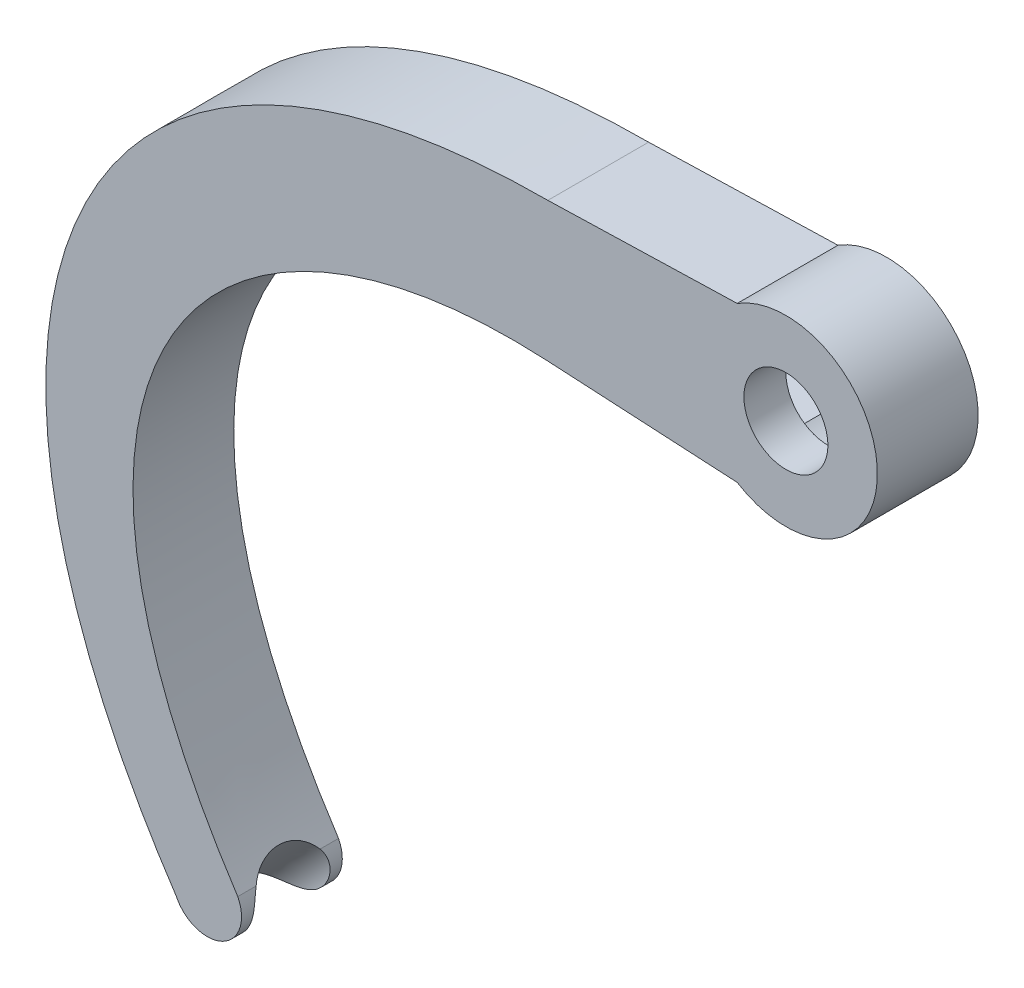
ISO-10303-21;
HEADER;
FILE_DESCRIPTION(('STEP AP214'),'2;1');
FILE_NAME('part.step','',(''),(''),'','','');
FILE_SCHEMA(('AUTOMOTIVE_DESIGN { 1 0 10303 214 1 1 1 1 }'));
ENDSEC;
DATA;
#1=APPLICATION_CONTEXT('core data for automotive mechanical design processes');
#2=APPLICATION_PROTOCOL_DEFINITION('international standard','automotive_design',2000,#1);
#3=PRODUCT_CONTEXT('',#1,'mechanical');
#4=PRODUCT('Part','Part','',(#3));
#5=PRODUCT_RELATED_PRODUCT_CATEGORY('part','',(#4));
#6=PRODUCT_DEFINITION_FORMATION('','',#4);
#7=PRODUCT_DEFINITION_CONTEXT('part definition',#1,'design');
#8=PRODUCT_DEFINITION('design','',#6,#7);
#9=PRODUCT_DEFINITION_SHAPE('','',#8);
#10=(LENGTH_UNIT() NAMED_UNIT(*) SI_UNIT(.MILLI.,.METRE.));
#11=(NAMED_UNIT(*) PLANE_ANGLE_UNIT() SI_UNIT($,.RADIAN.));
#12=(NAMED_UNIT(*) SI_UNIT($,.STERADIAN.) SOLID_ANGLE_UNIT());
#13=UNCERTAINTY_MEASURE_WITH_UNIT(LENGTH_MEASURE(1.E-05),#10,'distance_accuracy_value','');
#14=(GEOMETRIC_REPRESENTATION_CONTEXT(3) GLOBAL_UNCERTAINTY_ASSIGNED_CONTEXT((#13)) GLOBAL_UNIT_ASSIGNED_CONTEXT((#10,
#11,#12)) REPRESENTATION_CONTEXT('',''));
#15=CARTESIAN_POINT('',(0.,0.,0.));
#16=DIRECTION('',(0.,0.,1.));
#17=DIRECTION('',(1.,0.,0.));
#18=AXIS2_PLACEMENT_3D('',#15,#16,#17);
#19=CARTESIAN_POINT('',(-41.9332664034828,-10.07657373215,0.));
#20=DIRECTION('',(0.,0.,-1.));
#21=DIRECTION('',(-1.,0.,0.));
#22=AXIS2_PLACEMENT_3D('',#19,#20,#21);
#23=PLANE('',#22);
#24=DIRECTION('',(-0.999590434211399,-0.0286175441480638,0.));
#25=VECTOR('',#24,1.);
#26=CARTESIAN_POINT('',(-2.89851826531626,4.61531059254175,0.));
#27=LINE('',#26,#25);
#28=CARTESIAN_POINT('',(-2.89851826531626,4.61531059254175,0.));
#29=VERTEX_POINT('',#28);
#30=CARTESIAN_POINT('',(-14.1752919202389,4.29246479803185,0.));
#31=VERTEX_POINT('',#30);
#32=EDGE_CURVE('E161',#29,#31,#27,.T.);
#33=ORIENTED_EDGE('',*,*,#32,.F.);
#34=CARTESIAN_POINT('',(0.,0.,0.));
#35=DIRECTION('',(0.,0.,1.));
#36=DIRECTION('',(1.,0.,0.));
#37=AXIS2_PLACEMENT_3D('',#34,#35,#36);
#38=CIRCLE('',#37,5.45);
#39=CARTESIAN_POINT('',(-2.89851826531626,-4.61531059254175,0.));
#40=VERTEX_POINT('',#39);
#41=EDGE_CURVE('E192',#40,#29,#38,.T.);
#42=ORIENTED_EDGE('',*,*,#41,.F.);
#43=DIRECTION('',(0.998510440144325,-0.0545609835210728,0.));
#44=VECTOR('',#43,1.);
#45=CARTESIAN_POINT('',(-14.2682439340843,-3.9940417605773,0.));
#46=LINE('',#45,#44);
#47=CARTESIAN_POINT('',(-14.2682439340843,-3.9940417605773,0.));
#48=VERTEX_POINT('',#47);
#49=EDGE_CURVE('E187',#48,#40,#46,.T.);
#50=ORIENTED_EDGE('',*,*,#49,.F.);
#51=CARTESIAN_POINT('',(-14.2682439340843,-3.9940417605773,0.));
#52=CARTESIAN_POINT('',(-34.7311657897191,-2.87481631988076,0.));
#53=CARTESIAN_POINT('',(-47.0184138672704,-18.9715456050833,0.));
#54=CARTESIAN_POINT('',(-32.6407533174805,-40.8457065827944,0.));
#55=B_SPLINE_CURVE_WITH_KNOTS('',3,(#51,#52,#53,#54),.UNSPECIFIED.,.F.,.F.,(4,4),(0.,1.),.UNSPECIFIED.);
#56=CARTESIAN_POINT('',(-32.6407533174805,-40.8457065827944,0.));
#57=VERTEX_POINT('',#56);
#58=EDGE_CURVE('E182',#48,#57,#55,.T.);
#59=ORIENTED_EDGE('',*,*,#58,.T.);
#60=CARTESIAN_POINT('',(-34.4577656056994,-41.7788685475317,0.));
#61=DIRECTION('',(0.,0.,1.));
#62=DIRECTION('',(1.,0.,0.));
#63=AXIS2_PLACEMENT_3D('',#60,#61,#62);
#64=CIRCLE('',#63,2.04262696250956);
#65=CARTESIAN_POINT('',(-36.3027853217966,-42.6553542320605,0.));
#66=VERTEX_POINT('',#65);
#67=EDGE_CURVE('E168',#66,#57,#64,.T.);
#68=ORIENTED_EDGE('',*,*,#67,.F.);
#69=CARTESIAN_POINT('',(-14.1752919202389,4.29246479803185,0.));
#70=CARTESIAN_POINT('',(-42.4622601287805,4.28881821773357,0.));
#71=CARTESIAN_POINT('',(-52.533757866495,-18.3720516921241,0.));
#72=CARTESIAN_POINT('',(-36.3027853217966,-42.6553542320605,0.));
#73=B_SPLINE_CURVE_WITH_KNOTS('',3,(#69,#70,#71,#72),.UNSPECIFIED.,.F.,.F.,(4,4),(0.,1.),.UNSPECIFIED.);
#74=EDGE_CURVE('E154',#31,#66,#73,.T.);
#75=ORIENTED_EDGE('',*,*,#74,.F.);
#76=EDGE_LOOP('',(#33,#42,#50,#59,#68,#75));
#77=FACE_BOUND('',#76,.T.);
#78=DIRECTION('',(-0.998510440144325,-0.0545609835210729,0.));
#79=VECTOR('',#78,1.);
#80=CARTESIAN_POINT('',(-2.35931808461709,3.0423869207579,0.));
#81=LINE('',#80,#79);
#82=CARTESIAN_POINT('',(-2.35931808461709,3.0423869207579,0.));
#83=VERTEX_POINT('',#82);
#84=CARTESIAN_POINT('',(-14.1809463604506,2.39642505634638,0.));
#85=VERTEX_POINT('',#84);
#86=EDGE_CURVE('E282',#83,#85,#81,.T.);
#87=ORIENTED_EDGE('',*,*,#86,.T.);
#88=CARTESIAN_POINT('',(-14.05,0.,0.));
#89=DIRECTION('',(0.,0.,1.));
#90=DIRECTION('',(1.,0.,0.));
#91=AXIS2_PLACEMENT_3D('',#88,#89,#90);
#92=CIRCLE('',#91,2.4);
#93=CARTESIAN_POINT('',(-14.1809463604506,-2.39642505634638,0.));
#94=VERTEX_POINT('',#93);
#95=EDGE_CURVE('E64',#85,#94,#92,.T.);
#96=ORIENTED_EDGE('',*,*,#95,.T.);
#97=DIRECTION('',(0.998510440144325,-0.0545609835210727,0.));
#98=VECTOR('',#97,1.);
#99=CARTESIAN_POINT('',(-14.1809463604506,-2.39642505634638,0.));
#100=LINE('',#99,#98);
#101=CARTESIAN_POINT('',(-2.35931808461709,-3.0423869207579,0.));
#102=VERTEX_POINT('',#101);
#103=EDGE_CURVE('E289',#94,#102,#100,.T.);
#104=ORIENTED_EDGE('',*,*,#103,.T.);
#105=CARTESIAN_POINT('',(0.,0.,0.));
#106=DIRECTION('',(0.,0.,1.));
#107=DIRECTION('',(1.,0.,0.));
#108=AXIS2_PLACEMENT_3D('',#105,#106,#107);
#109=CIRCLE('',#108,3.85);
#110=EDGE_CURVE('E286',#102,#83,#109,.T.);
#111=ORIENTED_EDGE('',*,*,#110,.T.);
#112=EDGE_LOOP('',(#87,#96,#104,#111));
#113=FACE_BOUND('',#112,.T.);
#114=ADVANCED_FACE('F37',(#77,#113),#23,.T.);
#115=CARTESIAN_POINT('',(-2.89851826531626,4.61531059254175,6.));
#116=DIRECTION('',(0.0286175441480638,-0.999590434211399,0.));
#117=DIRECTION('',(0.999590434211399,0.0286175441480638,0.));
#118=AXIS2_PLACEMENT_3D('',#115,#116,#117);
#119=PLANE('',#118);
#120=ORIENTED_EDGE('',*,*,#32,.T.);
#121=DIRECTION('',(0.,0.,-1.));
#122=VECTOR('',#121,1.);
#123=CARTESIAN_POINT('',(-14.1752919202389,4.29246479803185,6.));
#124=LINE('',#123,#122);
#125=CARTESIAN_POINT('',(-14.1752919202389,4.29246479803185,6.));
#126=VERTEX_POINT('',#125);
#127=EDGE_CURVE('E51',#126,#31,#124,.T.);
#128=ORIENTED_EDGE('',*,*,#127,.F.);
#129=DIRECTION('',(-0.999590434211399,-0.0286175441480638,0.));
#130=VECTOR('',#129,1.);
#131=CARTESIAN_POINT('',(-2.89851826531626,4.61531059254175,6.));
#132=LINE('',#131,#130);
#133=CARTESIAN_POINT('',(-2.89851826531626,4.61531059254175,6.));
#134=VERTEX_POINT('',#133);
#135=EDGE_CURVE('E194',#134,#126,#132,.T.);
#136=ORIENTED_EDGE('',*,*,#135,.F.);
#137=DIRECTION('',(0.,0.,-1.));
#138=VECTOR('',#137,1.);
#139=CARTESIAN_POINT('',(-2.89851826531626,4.61531059254175,6.));
#140=LINE('',#139,#138);
#141=EDGE_CURVE('E163',#134,#29,#140,.T.);
#142=ORIENTED_EDGE('',*,*,#141,.T.);
#143=EDGE_LOOP('',(#120,#128,#136,#142));
#144=FACE_BOUND('',#143,.T.);
#145=ADVANCED_FACE('F39',(#144),#119,.F.);
#146=CARTESIAN_POINT('',(-14.1752919202389,4.29246479803185,6.));
#147=CARTESIAN_POINT('',(-42.4622601287805,4.28881821773357,6.));
#148=CARTESIAN_POINT('',(-52.533757866495,-18.3720516921241,6.));
#149=CARTESIAN_POINT('',(-36.3027853217966,-42.6553542320605,6.));
#150=B_SPLINE_CURVE_WITH_KNOTS('',3,(#146,#147,#148,#149),.UNSPECIFIED.,.F.,.F.,(4,4),(0.,1.),.UNSPECIFIED.);
#151=DIRECTION('',(0.,0.,-1.));
#152=VECTOR('',#151,1.);
#153=SURFACE_OF_LINEAR_EXTRUSION('',#150,#152);
#154=ORIENTED_EDGE('',*,*,#74,.T.);
#155=DIRECTION('',(0.,0.,-1.));
#156=VECTOR('',#155,1.);
#157=CARTESIAN_POINT('',(-36.3027853217966,-42.6553542320605,6.));
#158=LINE('',#157,#156);
#159=CARTESIAN_POINT('',(-36.3027853217966,-42.6553542320605,6.));
#160=VERTEX_POINT('',#159);
#161=EDGE_CURVE('E141',#160,#66,#158,.T.);
#162=ORIENTED_EDGE('',*,*,#161,.F.);
#163=EDGE_CURVE('E155',#126,#160,#150,.T.);
#164=ORIENTED_EDGE('',*,*,#163,.F.);
#165=ORIENTED_EDGE('',*,*,#127,.T.);
#166=EDGE_LOOP('',(#154,#162,#164,#165));
#167=FACE_BOUND('',#166,.T.);
#168=ADVANCED_FACE('F152',(#167),#153,.F.);
#169=CARTESIAN_POINT('',(-34.4577656056994,-41.7788685475317,6.));
#170=DIRECTION('',(0.,0.,-1.));
#171=DIRECTION('',(-1.,0.,0.));
#172=AXIS2_PLACEMENT_3D('',#169,#170,#171);
#173=CYLINDRICAL_SURFACE('',#172,2.04262696250956);
#174=DIRECTION('',(0.,0.,-1.));
#175=VECTOR('',#174,1.);
#176=CARTESIAN_POINT('',(-32.6407533174805,-40.8457065827944,6.));
#177=LINE('',#176,#175);
#178=CARTESIAN_POINT('',(-32.6407533174805,-40.8457065827944,1.09503326228966));
#179=VERTEX_POINT('',#178);
#180=EDGE_CURVE('E135',#179,#57,#177,.T.);
#181=ORIENTED_EDGE('',*,*,#180,.F.);
#182=CARTESIAN_POINT('',(-32.6407533174804,-40.8457065827945,1.09503326228966));
#183=CARTESIAN_POINT('',(-32.6220745355062,-40.8820558724806,1.0687277977726));
#184=CARTESIAN_POINT('',(-32.6040911412782,-40.9197782200192,1.04382025247696));
#185=CARTESIAN_POINT('',(-32.5699296706582,-40.9977151214801,0.996830357177304));
#186=CARTESIAN_POINT('',(-32.5537515457497,-41.037929608381,0.974747931246036));
#187=CARTESIAN_POINT('',(-32.5236779395172,-41.1204237643003,0.933523713846802));
#188=CARTESIAN_POINT('',(-32.5097730790598,-41.1626939634419,0.914369861898414));
#189=CARTESIAN_POINT('',(-32.4845179807851,-41.2491045182225,0.878840719121569));
#190=CARTESIAN_POINT('',(-32.4731675380123,-41.2932447234824,0.862465205397218));
#191=CARTESIAN_POINT('',(-32.4433979741694,-41.428038739852,0.817319240428282));
#192=CARTESIAN_POINT('',(-32.4292664084087,-41.5210504774572,0.792536906367486));
#193=CARTESIAN_POINT('',(-32.4140933560802,-41.7100073273682,0.752093156564916));
#194=CARTESIAN_POINT('',(-32.4130565214455,-41.8059534699949,0.73643498408661));
#195=CARTESIAN_POINT('',(-32.4247275498036,-41.9993315275777,0.711865207444093));
#196=CARTESIAN_POINT('',(-32.4376441069325,-42.0967639070497,0.703059525105339));
#197=CARTESIAN_POINT('',(-32.4774439249368,-42.2890758503037,0.69024824720019));
#198=CARTESIAN_POINT('',(-32.5043362600976,-42.3839537133242,0.68624577588836));
#199=CARTESIAN_POINT('',(-32.57509966898,-42.5786959586113,0.680676717238283));
#200=CARTESIAN_POINT('',(-32.6204642460473,-42.6780283208868,0.679412118488387));
#201=CARTESIAN_POINT('',(-32.7264253508892,-42.8681998254043,0.678088108703343));
#202=CARTESIAN_POINT('',(-32.787023204055,-42.9590382276742,0.67802880257304));
#203=CARTESIAN_POINT('',(-32.9253414906563,-43.1342567493569,0.677967891577978));
#204=CARTESIAN_POINT('',(-33.0037741418237,-43.2180761214555,0.677969363853455));
#205=CARTESIAN_POINT('',(-33.1735724997054,-43.3714335399114,0.678027846176016));
#206=CARTESIAN_POINT('',(-33.2649413688916,-43.4409680838885,0.678084869823654));
#207=CARTESIAN_POINT('',(-33.4583960197149,-43.5640267860091,0.679604908684623));
#208=CARTESIAN_POINT('',(-33.5605239882093,-43.6174844928451,0.681073656972305));
#209=CARTESIAN_POINT('',(-33.7723113532011,-43.7064673345895,0.687993748797654));
#210=CARTESIAN_POINT('',(-33.8819712716008,-43.7419912254047,0.693445368568312));
#211=CARTESIAN_POINT('',(-34.0482157327862,-43.780811717667,0.70708570052062));
#212=CARTESIAN_POINT('',(-34.1034355069909,-43.7913104977763,0.712473164078317));
#213=CARTESIAN_POINT('',(-34.2142847405185,-43.8077038324202,0.725482866210588));
#214=CARTESIAN_POINT('',(-34.269913974032,-43.8136007570793,0.733103951601973));
#215=CARTESIAN_POINT('',(-34.3809998100799,-43.820811116298,0.751012141451185));
#216=CARTESIAN_POINT('',(-34.436456508161,-43.8221278523896,0.761297319805349));
#217=CARTESIAN_POINT('',(-34.5466369734369,-43.8203044543135,0.784944839957722));
#218=CARTESIAN_POINT('',(-34.6013608305543,-43.8171648721068,0.798306800492915));
#219=CARTESIAN_POINT('',(-34.7043662894247,-43.8071521778731,0.827035574577063));
#220=CARTESIAN_POINT('',(-34.7527703594427,-43.8006572677649,0.842096378703845));
#221=CARTESIAN_POINT('',(-34.848006729531,-43.7844533783087,0.875223270784623));
#222=CARTESIAN_POINT('',(-34.8948385120502,-43.7747433518446,0.89329033687894));
#223=CARTESIAN_POINT('',(-34.9864338822384,-43.7524576367463,0.932529518658113));
#224=CARTESIAN_POINT('',(-35.0311990230519,-43.7398841436929,0.953699250944259));
#225=CARTESIAN_POINT('',(-35.1183169611923,-43.7122824623302,0.999182693206804));
#226=CARTESIAN_POINT('',(-35.1606688604072,-43.6972533680884,1.02349756281023));
#227=CARTESIAN_POINT('',(-35.277496837116,-43.6515607442756,1.09726230793636));
#228=CARTESIAN_POINT('',(-35.3486853237578,-43.6184649473605,1.15051192532821));
#229=CARTESIAN_POINT('',(-35.4804103893852,-43.5486447470524,1.26681160939616));
#230=CARTESIAN_POINT('',(-35.540940759043,-43.5119182477686,1.32986734901833));
#231=CARTESIAN_POINT('',(-35.655308761074,-43.4351622395027,1.46955762770075));
#232=CARTESIAN_POINT('',(-35.708305676322,-43.395091350914,1.5468554375091));
#233=CARTESIAN_POINT('',(-35.8023557385352,-43.317736686436,1.70952851931919));
#234=CARTESIAN_POINT('',(-35.84341350868,-43.2804518358797,1.79490064769648));
#235=CARTESIAN_POINT('',(-35.9200374751139,-43.2062291506407,1.98559953498169));
#236=CARTESIAN_POINT('',(-35.9538431257085,-43.1701907078841,2.09199444454442));
#237=CARTESIAN_POINT('',(-35.9948583352088,-43.1242623702573,2.25612053436973));
#238=CARTESIAN_POINT('',(-36.0069151261159,-43.1103069906349,2.31158964801472));
#239=CARTESIAN_POINT('',(-36.0279805775476,-43.0853961377285,2.42382929335551));
#240=CARTESIAN_POINT('',(-36.0369861685367,-43.0744436875193,2.48060107462212));
#241=CARTESIAN_POINT('',(-36.059784553719,-43.0463378666881,2.65368264922793));
#242=CARTESIAN_POINT('',(-36.0690519220353,-43.0343007801625,2.77149430671863));
#243=CARTESIAN_POINT('',(-36.0761653321202,-43.0251212864623,3.00804248645508));
#244=CARTESIAN_POINT('',(-36.074011572471,-43.0279786203145,3.12677899258438));
#245=CARTESIAN_POINT('',(-36.0618965104243,-43.0434299115403,3.30656770952968));
#246=CARTESIAN_POINT('',(-36.056095833202,-43.0507971209983,3.36841838668217));
#247=CARTESIAN_POINT('',(-36.0411649830849,-43.0693404785519,3.49109996479183));
#248=CARTESIAN_POINT('',(-36.0320375150728,-43.0805135317839,3.5519316523401));
#249=CARTESIAN_POINT('',(-36.0103037917086,-43.1063599725711,3.67222177951734));
#250=CARTESIAN_POINT('',(-35.9976968972214,-43.1210340031529,3.73167996467131));
#251=CARTESIAN_POINT('',(-35.9688076639993,-43.1534771440972,3.84885238595402));
#252=CARTESIAN_POINT('',(-35.9525243455893,-43.1712470791522,3.90656615258226));
#253=CARTESIAN_POINT('',(-35.9162559272668,-43.2091872554053,4.01925187499024));
#254=CARTESIAN_POINT('',(-35.8963126235021,-43.2293295571905,4.07424668018053));
#255=CARTESIAN_POINT('',(-35.8523850928272,-43.2716144941285,4.18177749023772));
#256=CARTESIAN_POINT('',(-35.8284023407947,-43.2937563978256,4.23431438362013));
#257=CARTESIAN_POINT('',(-35.7780097894387,-43.3378163715659,4.33296438080898));
#258=CARTESIAN_POINT('',(-35.7518922973123,-43.3596391719485,4.37926889576299));
#259=CARTESIAN_POINT('',(-35.6957912760213,-43.4039525755436,4.46919619988889));
#260=CARTESIAN_POINT('',(-35.6658039640778,-43.4264438153807,4.51281630258253));
#261=CARTESIAN_POINT('',(-35.5744858581311,-43.4907435191728,4.63304131018049));
#262=CARTESIAN_POINT('',(-35.5082598687128,-43.5326438343903,4.70599840366427));
#263=CARTESIAN_POINT('',(-35.3621382050694,-43.6122641759943,4.83956812918746));
#264=CARTESIAN_POINT('',(-35.2822401780771,-43.6499834810433,4.90017863261189));
#265=CARTESIAN_POINT('',(-35.1130164609566,-43.7156035194152,5.00613903751315));
#266=CARTESIAN_POINT('',(-35.024048169081,-43.7437662729535,5.05189437745837));
#267=CARTESIAN_POINT('',(-34.8378453787744,-43.7880994018402,5.13052808010024));
#268=CARTESIAN_POINT('',(-34.7406134044559,-43.8042734245344,5.16341035774628));
#269=CARTESIAN_POINT('',(-34.5502981101528,-43.8214433626216,5.2153438892698));
#270=CARTESIAN_POINT('',(-34.4575710483966,-43.8236189472126,5.23533743516759));
#271=CARTESIAN_POINT('',(-34.2713678575712,-43.8151085848169,5.26751928083455));
#272=CARTESIAN_POINT('',(-34.1778915171218,-43.804418871732,5.27970529348008));
#273=CARTESIAN_POINT('',(-33.9870084742011,-43.7690232872379,5.29893494992747));
#274=CARTESIAN_POINT('',(-33.8897204484149,-43.7434845014914,5.30561029768432));
#275=CARTESIAN_POINT('',(-33.6997819726218,-43.6783109898578,5.3149224238759));
#276=CARTESIAN_POINT('',(-33.6071335382778,-43.6386701969553,5.31755746147907));
#277=CARTESIAN_POINT('',(-33.419662773451,-43.5415081744841,5.32097260122543));
#278=CARTESIAN_POINT('',(-33.3255576455255,-43.482590399137,5.32153968133249));
#279=CARTESIAN_POINT('',(-33.1481240750929,-43.3503063405342,5.32205860158612));
#280=CARTESIAN_POINT('',(-33.0647967680405,-43.2769385370036,5.32201037696292));
#281=CARTESIAN_POINT('',(-32.9083376289744,-43.1148091736158,5.32201342232842));
#282=CARTESIAN_POINT('',(-32.8356802782925,-43.025588865463,5.32206833313781));
#283=CARTESIAN_POINT('',(-32.706321949199,-42.8361885564295,5.32171665012835));
#284=CARTESIAN_POINT('',(-32.6496279810467,-42.7360037672733,5.32130985394589));
#285=CARTESIAN_POINT('',(-32.5537698971929,-42.527419643751,5.31815058504528));
#286=CARTESIAN_POINT('',(-32.51463318443,-42.4190077749228,5.3153944648661));
#287=CARTESIAN_POINT('',(-32.4551842779756,-42.1973334462995,5.30454548177612));
#288=CARTESIAN_POINT('',(-32.4348609047998,-42.084073909064,5.29645579314149));
#289=CARTESIAN_POINT('',(-32.4189526371379,-41.9154275662223,5.27780793955972));
#290=CARTESIAN_POINT('',(-32.4160181849771,-41.8602679683904,5.27066523167248));
#291=CARTESIAN_POINT('',(-32.4146005634156,-41.7502877815356,5.25384820122454));
#292=CARTESIAN_POINT('',(-32.416115016718,-41.6954670271389,5.24417523323852));
#293=CARTESIAN_POINT('',(-32.4234646055162,-41.5867373592428,5.22190308009144));
#294=CARTESIAN_POINT('',(-32.4292981774195,-41.5328281229809,5.20930495501821));
#295=CARTESIAN_POINT('',(-32.4450422106987,-41.4265141484661,5.18084101307702));
#296=CARTESIAN_POINT('',(-32.4549502404827,-41.3741085327898,5.16497714798217));
#297=CARTESIAN_POINT('',(-32.4766750226527,-41.279273480035,5.13243357233907));
#298=CARTESIAN_POINT('',(-32.4879636567345,-41.2365495651157,5.11625480556181));
#299=CARTESIAN_POINT('',(-32.5129243674463,-41.1529117280944,5.08127143653079));
#300=CARTESIAN_POINT('',(-32.5265962876764,-41.1119976874427,5.06246700659861));
#301=CARTESIAN_POINT('',(-32.5560530180107,-41.0321213751724,5.02210815799233));
#302=CARTESIAN_POINT('',(-32.5718459776711,-40.9931674706489,5.00054314825586));
#303=CARTESIAN_POINT('',(-32.6051250614893,-40.9176125882504,4.954747094853));
#304=CARTESIAN_POINT('',(-32.622611416337,-40.8810119320899,4.93051568788392));
#305=CARTESIAN_POINT('',(-32.6407533174804,-40.8457065827946,4.90496673771031));
#306=B_SPLINE_CURVE_WITH_KNOTS('',3,(#182,#183,#184,#185,#186,#187,#188,#189,#190,#191,#192,
#193,#194,#195,#196,#197,#198,#199,#200,#201,#202,#203,#204,#205,#206,#207,#208,#209,#210,#211,
#212,#213,#214,#215,#216,#217,#218,#219,#220,#221,#222,#223,#224,#225,#226,#227,#228,#229,#230,
#231,#232,#233,#234,#235,#236,#237,#238,#239,#240,#241,#242,#243,#244,#245,#246,#247,#248,#249,
#250,#251,#252,#253,#254,#255,#256,#257,#258,#259,#260,#261,#262,#263,#264,#265,#266,#267,#268,
#269,#270,#271,#272,#273,#274,#275,#276,#277,#278,#279,#280,#281,#282,#283,#284,#285,#286,#287,
#288,#289,#290,#291,#292,#293,#294,#295,#296,#297,#298,#299,#300,#301,#302,#303,#304,#305),
.UNSPECIFIED.,.F.,.F.,(4,2,2,2,2,2,2,2,2,2,2,2,2,2,2,2,2,2,2,2,2,2,2,2,2,2,2,2,2,2,2,2,2,2,2,2,
2,2,2,2,2,2,2,2,2,2,2,2,2,2,2,2,2,2,2,2,2,2,2,2,2,4),(0.,0.14576635828153,0.291528798156639,
0.436673778110588,0.581807108102921,0.872127517188236,1.16255106036363,1.45737924229694,
1.75239909182348,2.07858438762317,2.40479807343445,2.74754690327221,3.09037966885818,
3.43461060135937,3.77886541034463,3.94807498204079,4.1171973469731,4.28619777833417,
4.45517727907083,4.60829190643422,4.76145645010642,4.91450394696879,5.06760803487979,
5.35082715317151,5.63421073045381,5.93881713256242,6.2433054247829,6.59368902271421,
6.76890993489393,6.94430660114618,7.29910991047247,7.65390705075918,7.84139708667637,
8.02873502064223,8.21610738960151,8.40352974766615,8.5889317535275,8.77426621182923,
8.94647086477887,9.11884514257452,9.4384436327961,9.75809717687675,10.0681013862676,
10.3780112439561,10.6614193850928,10.9449105093482,11.2460898979095,11.5473990179469,
11.8789879966711,12.2106118802386,12.5541630011611,12.8978647567975,13.2421011031982,
13.5861327618641,13.753032583483,13.9198432375015,14.0865935328132,14.2532444574576,
14.3942581535202,14.5352625992376,14.6768252052058,14.8184071233406),.UNSPECIFIED.);
#307=CARTESIAN_POINT('',(-32.6407533174804,-40.8457065827945,4.90496673771047));
#308=VERTEX_POINT('',#307);
#309=EDGE_CURVE('E56',#179,#308,#306,.T.);
#310=ORIENTED_EDGE('',*,*,#309,.T.);
#311=CARTESIAN_POINT('',(-32.6407533174805,-40.8457065827944,6.));
#312=VERTEX_POINT('',#311);
#313=EDGE_CURVE('E132',#312,#308,#177,.T.);
#314=ORIENTED_EDGE('',*,*,#313,.F.);
#315=CARTESIAN_POINT('',(-34.4577656056994,-41.7788685475317,6.));
#316=DIRECTION('',(0.,0.,1.));
#317=DIRECTION('',(1.,0.,0.));
#318=AXIS2_PLACEMENT_3D('',#315,#316,#317);
#319=CIRCLE('',#318,2.04262696250956);
#320=EDGE_CURVE('E208',#160,#312,#319,.T.);
#321=ORIENTED_EDGE('',*,*,#320,.F.);
#322=ORIENTED_EDGE('',*,*,#161,.T.);
#323=ORIENTED_EDGE('',*,*,#67,.T.);
#324=EDGE_LOOP('',(#181,#310,#314,#321,#322,#323));
#325=FACE_BOUND('',#324,.T.);
#326=ADVANCED_FACE('F130',(#325),#173,.T.);
#327=CARTESIAN_POINT('',(-14.2682439340843,-3.9940417605773,6.));
#328=CARTESIAN_POINT('',(-34.7311657897191,-2.87481631988076,6.));
#329=CARTESIAN_POINT('',(-47.0184138672704,-18.9715456050833,6.));
#330=CARTESIAN_POINT('',(-32.6407533174805,-40.8457065827944,6.));
#331=B_SPLINE_CURVE_WITH_KNOTS('',3,(#327,#328,#329,#330),.UNSPECIFIED.,.F.,.F.,(4,4),(0.,1.),.UNSPECIFIED.);
#332=DIRECTION('',(0.,0.,-1.));
#333=VECTOR('',#332,1.);
#334=SURFACE_OF_LINEAR_EXTRUSION('',#331,#333);
#335=CARTESIAN_POINT('',(-32.6407533174804,-40.8457065827945,1.09503326228966));
#336=CARTESIAN_POINT('',(-32.6707717794153,-40.8000374671283,1.13132589126215));
#337=CARTESIAN_POINT('',(-32.6999187418871,-40.7555407018418,1.16982213492498));
#338=CARTESIAN_POINT('',(-32.7563022274618,-40.6692001630969,1.25101207092125));
#339=CARTESIAN_POINT('',(-32.783537834231,-40.6273576630459,1.29370775329187));
#340=CARTESIAN_POINT('',(-32.8359061042891,-40.5466721041824,1.38305838951742));
#341=CARTESIAN_POINT('',(-32.8610384561357,-40.5078294896474,1.42971392768028));
#342=CARTESIAN_POINT('',(-32.9090133525323,-40.4334871657255,1.52668557805962));
#343=CARTESIAN_POINT('',(-32.9318568304473,-40.3979860940733,1.57700018360459));
#344=CARTESIAN_POINT('',(-32.9745612114682,-40.3314607152494,1.67970338196523));
#345=CARTESIAN_POINT('',(-32.994482438364,-40.3003466234169,1.73200858716873));
#346=CARTESIAN_POINT('',(-33.0318790989632,-40.2418177924835,1.83954670611475));
#347=CARTESIAN_POINT('',(-33.0493519265236,-40.214406996367,1.89478265451548));
#348=CARTESIAN_POINT('',(-33.0976104692377,-40.1385671056776,2.06341214302111));
#349=CARTESIAN_POINT('',(-33.1246040136865,-40.0959558657306,2.18061284050957));
#350=CARTESIAN_POINT('',(-33.1674837011866,-40.0281364447919,2.42187555788211));
#351=CARTESIAN_POINT('',(-33.1833728609801,-40.0029235371967,2.54593570435993));
#352=CARTESIAN_POINT('',(-33.1984003765217,-39.9790631511722,2.73298449350545));
#353=CARTESIAN_POINT('',(-33.2019491110799,-39.9734248081233,2.79482235859401));
#354=CARTESIAN_POINT('',(-33.206249435844,-39.9665915433258,2.91880228146406));
#355=CARTESIAN_POINT('',(-33.2070034468932,-39.9653927759319,2.98094402926544));
#356=CARTESIAN_POINT('',(-33.2057211158691,-39.9674307904694,3.10416905816639));
#357=CARTESIAN_POINT('',(-33.2037273264176,-39.9705999307366,3.1652539758451));
#358=CARTESIAN_POINT('',(-33.1970416039768,-39.9812207781195,3.28690196349449));
#359=CARTESIAN_POINT('',(-33.1923496534616,-39.9886725130526,3.34746503007291));
#360=CARTESIAN_POINT('',(-33.180305267606,-40.0077843405542,3.46762894914944));
#361=CARTESIAN_POINT('',(-33.1729540662719,-40.0194424811636,3.52723023457658));
#362=CARTESIAN_POINT('',(-33.1556452999691,-40.046858902899,3.64513001157972));
#363=CARTESIAN_POINT('',(-33.1456857386026,-40.0626203245565,3.70342746796821));
#364=CARTESIAN_POINT('',(-33.1117163140888,-40.1162988449354,3.87718648404486));
#365=CARTESIAN_POINT('',(-33.0837618495907,-40.1603770252344,3.99005917777625));
#366=CARTESIAN_POINT('',(-33.0182329328003,-40.2632392644667,4.20588375450156));
#367=CARTESIAN_POINT('',(-32.9806553361128,-40.3220281300289,4.30883237960513));
#368=CARTESIAN_POINT('',(-32.9181317544818,-40.4193176942957,4.45339792113911));
#369=CARTESIAN_POINT('',(-32.8963992200512,-40.4530571036623,4.49971739812613));
#370=CARTESIAN_POINT('',(-32.8509954672815,-40.5233539628618,4.58907287217802));
#371=CARTESIAN_POINT('',(-32.8273265535772,-40.5599080597549,4.63211265807958));
#372=CARTESIAN_POINT('',(-32.7775667671874,-40.6365342154443,4.7157554877758));
#373=CARTESIAN_POINT('',(-32.7514305794132,-40.6766707748459,4.75627233004417));
#374=CARTESIAN_POINT('',(-32.6973810470962,-40.7594144532318,4.83352234667172));
#375=CARTESIAN_POINT('',(-32.6694658971984,-40.8020240779301,4.87025157500826));
#376=CARTESIAN_POINT('',(-32.6407533174805,-40.8457065827944,4.90496673771042));
#377=B_SPLINE_CURVE_WITH_KNOTS('',3,(#335,#336,#337,#338,#339,#340,#341,#342,#343,#344,#345,
#346,#347,#348,#349,#350,#351,#352,#353,#354,#355,#356,#357,#358,#359,#360,#361,#362,#363,#364,
#365,#366,#367,#368,#369,#370,#371,#372,#373,#374,#375,#376),.UNSPECIFIED.,.F.,.F.,(4,2,2,2,2,2,
2,2,2,2,2,2,2,2,2,2,2,2,2,2,4),(0.,0.196766592295486,0.39362688208892,0.590516270840192,
0.787325041757335,0.979209679194269,1.17129703708369,1.55216004275632,1.93291953863023,
2.11932201108642,2.30556298034606,2.48895199110019,2.67234219306158,2.855647403034,
3.0390933240406,3.4103748791041,3.78177790697811,3.9654877169104,4.14898197464843,
4.33699871739656,4.52520940231183),.UNSPECIFIED.);
#378=EDGE_CURVE('E11',#179,#308,#377,.T.);
#379=ORIENTED_EDGE('',*,*,#378,.F.);
#380=ORIENTED_EDGE('',*,*,#180,.T.);
#381=ORIENTED_EDGE('',*,*,#58,.F.);
#382=DIRECTION('',(0.,0.,-1.));
#383=VECTOR('',#382,1.);
#384=CARTESIAN_POINT('',(-14.2682439340843,-3.9940417605773,6.));
#385=LINE('',#384,#383);
#386=CARTESIAN_POINT('',(-14.2682439340843,-3.9940417605773,6.));
#387=VERTEX_POINT('',#386);
#388=EDGE_CURVE('E145',#387,#48,#385,.T.);
#389=ORIENTED_EDGE('',*,*,#388,.F.);
#390=EDGE_CURVE('E140',#387,#312,#331,.T.);
#391=ORIENTED_EDGE('',*,*,#390,.T.);
#392=ORIENTED_EDGE('',*,*,#313,.T.);
#393=EDGE_LOOP('',(#379,#380,#381,#389,#391,#392));
#394=FACE_BOUND('',#393,.T.);
#395=ADVANCED_FACE('F138',(#394),#334,.T.);
#396=CARTESIAN_POINT('',(-14.2682439340843,-3.9940417605773,6.));
#397=DIRECTION('',(0.0545609835210728,0.998510440144325,0.));
#398=DIRECTION('',(-0.998510440144325,0.0545609835210728,0.));
#399=AXIS2_PLACEMENT_3D('',#396,#397,#398);
#400=PLANE('',#399);
#401=ORIENTED_EDGE('',*,*,#49,.T.);
#402=DIRECTION('',(0.,0.,-1.));
#403=VECTOR('',#402,1.);
#404=CARTESIAN_POINT('',(-2.89851826531626,-4.61531059254175,6.));
#405=LINE('',#404,#403);
#406=CARTESIAN_POINT('',(-2.89851826531626,-4.61531059254175,6.));
#407=VERTEX_POINT('',#406);
#408=EDGE_CURVE('E195',#407,#40,#405,.T.);
#409=ORIENTED_EDGE('',*,*,#408,.F.);
#410=DIRECTION('',(0.998510440144325,-0.0545609835210728,0.));
#411=VECTOR('',#410,1.);
#412=CARTESIAN_POINT('',(-14.2682439340843,-3.9940417605773,6.));
#413=LINE('',#412,#411);
#414=EDGE_CURVE('E204',#387,#407,#413,.T.);
#415=ORIENTED_EDGE('',*,*,#414,.F.);
#416=ORIENTED_EDGE('',*,*,#388,.T.);
#417=EDGE_LOOP('',(#401,#409,#415,#416));
#418=FACE_BOUND('',#417,.T.);
#419=ADVANCED_FACE('F203',(#418),#400,.F.);
#420=CARTESIAN_POINT('',(0.,0.,6.));
#421=DIRECTION('',(0.,0.,-1.));
#422=DIRECTION('',(-1.,0.,0.));
#423=AXIS2_PLACEMENT_3D('',#420,#421,#422);
#424=CYLINDRICAL_SURFACE('',#423,5.45);
#425=ORIENTED_EDGE('',*,*,#41,.T.);
#426=ORIENTED_EDGE('',*,*,#141,.F.);
#427=CARTESIAN_POINT('',(0.,0.,6.));
#428=DIRECTION('',(0.,0.,1.));
#429=DIRECTION('',(1.,0.,0.));
#430=AXIS2_PLACEMENT_3D('',#427,#428,#429);
#431=CIRCLE('',#430,5.45);
#432=EDGE_CURVE('E173',#407,#134,#431,.T.);
#433=ORIENTED_EDGE('',*,*,#432,.F.);
#434=ORIENTED_EDGE('',*,*,#408,.T.);
#435=EDGE_LOOP('',(#425,#426,#433,#434));
#436=FACE_BOUND('',#435,.T.);
#437=ADVANCED_FACE('F268',(#436),#424,.T.);
#438=CARTESIAN_POINT('',(-41.9332664034828,-10.07657373215,6.));
#439=DIRECTION('',(0.,0.,-1.));
#440=DIRECTION('',(-1.,0.,0.));
#441=AXIS2_PLACEMENT_3D('',#438,#439,#440);
#442=PLANE('',#441);
#443=CARTESIAN_POINT('',(0.,0.,6.));
#444=DIRECTION('',(0.,0.,-1.));
#445=DIRECTION('',(-1.,0.,0.));
#446=AXIS2_PLACEMENT_3D('',#443,#444,#445);
#447=CIRCLE('',#446,2.5);
#448=CARTESIAN_POINT('',(-2.5,0.,6.));
#449=VERTEX_POINT('',#448);
#450=EDGE_CURVE('E293',#449,#449,#447,.T.);
#451=ORIENTED_EDGE('',*,*,#450,.T.);
#452=EDGE_LOOP('',(#451));
#453=FACE_BOUND('',#452,.T.);
#454=ORIENTED_EDGE('',*,*,#135,.T.);
#455=ORIENTED_EDGE('',*,*,#163,.T.);
#456=ORIENTED_EDGE('',*,*,#320,.T.);
#457=ORIENTED_EDGE('',*,*,#390,.F.);
#458=ORIENTED_EDGE('',*,*,#414,.T.);
#459=ORIENTED_EDGE('',*,*,#432,.T.);
#460=EDGE_LOOP('',(#454,#455,#456,#457,#458,#459));
#461=FACE_BOUND('',#460,.T.);
#462=ADVANCED_FACE('F265',(#453,#461),#442,.F.);
#463=CARTESIAN_POINT('',(-14.05,0.,3.5));
#464=DIRECTION('',(0.,0.,-1.));
#465=DIRECTION('',(-1.,0.,0.));
#466=AXIS2_PLACEMENT_3D('',#463,#464,#465);
#467=CYLINDRICAL_SURFACE('',#466,2.4);
#468=ORIENTED_EDGE('',*,*,#95,.F.);
#469=DIRECTION('',(0.,0.,-1.));
#470=VECTOR('',#469,1.);
#471=CARTESIAN_POINT('',(-14.1809463604506,2.39642505634638,3.5));
#472=LINE('',#471,#470);
#473=CARTESIAN_POINT('',(-14.1809463604506,2.39642505634638,3.5));
#474=VERTEX_POINT('',#473);
#475=EDGE_CURVE('E279',#474,#85,#472,.T.);
#476=ORIENTED_EDGE('',*,*,#475,.F.);
#477=CARTESIAN_POINT('',(-14.05,0.,3.5));
#478=DIRECTION('',(0.,0.,1.));
#479=DIRECTION('',(1.,0.,0.));
#480=AXIS2_PLACEMENT_3D('',#477,#478,#479);
#481=CIRCLE('',#480,2.4);
#482=CARTESIAN_POINT('',(-14.1809463604506,-2.39642505634638,3.5));
#483=VERTEX_POINT('',#482);
#484=EDGE_CURVE('E285',#474,#483,#481,.T.);
#485=ORIENTED_EDGE('',*,*,#484,.T.);
#486=DIRECTION('',(0.,0.,-1.));
#487=VECTOR('',#486,1.);
#488=CARTESIAN_POINT('',(-14.1809463604506,-2.39642505634638,3.5));
#489=LINE('',#488,#487);
#490=EDGE_CURVE('E166',#483,#94,#489,.T.);
#491=ORIENTED_EDGE('',*,*,#490,.T.);
#492=EDGE_LOOP('',(#468,#476,#485,#491));
#493=FACE_BOUND('',#492,.T.);
#494=ADVANCED_FACE('F261',(#493),#467,.F.);
#495=CARTESIAN_POINT('',(-14.1809463604506,-2.39642505634638,3.5));
#496=DIRECTION('',(0.0545609835210727,0.998510440144325,0.));
#497=DIRECTION('',(-0.998510440144325,0.0545609835210727,0.));
#498=AXIS2_PLACEMENT_3D('',#495,#496,#497);
#499=PLANE('',#498);
#500=ORIENTED_EDGE('',*,*,#103,.F.);
#501=ORIENTED_EDGE('',*,*,#490,.F.);
#502=DIRECTION('',(0.998510440144325,-0.0545609835210727,0.));
#503=VECTOR('',#502,1.);
#504=CARTESIAN_POINT('',(-14.1809463604506,-2.39642505634638,3.5));
#505=LINE('',#504,#503);
#506=CARTESIAN_POINT('',(-2.35931808461709,-3.0423869207579,3.5));
#507=VERTEX_POINT('',#506);
#508=EDGE_CURVE('E297',#483,#507,#505,.T.);
#509=ORIENTED_EDGE('',*,*,#508,.T.);
#510=DIRECTION('',(0.,0.,-1.));
#511=VECTOR('',#510,1.);
#512=CARTESIAN_POINT('',(-2.35931808461709,-3.0423869207579,3.5));
#513=LINE('',#512,#511);
#514=EDGE_CURVE('E170',#507,#102,#513,.T.);
#515=ORIENTED_EDGE('',*,*,#514,.T.);
#516=EDGE_LOOP('',(#500,#501,#509,#515));
#517=FACE_BOUND('',#516,.T.);
#518=ADVANCED_FACE('F257',(#517),#499,.T.);
#519=CARTESIAN_POINT('',(0.,0.,3.5));
#520=DIRECTION('',(0.,0.,-1.));
#521=DIRECTION('',(-1.,0.,0.));
#522=AXIS2_PLACEMENT_3D('',#519,#520,#521);
#523=CYLINDRICAL_SURFACE('',#522,3.85);
#524=ORIENTED_EDGE('',*,*,#110,.F.);
#525=ORIENTED_EDGE('',*,*,#514,.F.);
#526=CARTESIAN_POINT('',(0.,0.,3.5));
#527=DIRECTION('',(0.,0.,1.));
#528=DIRECTION('',(1.,0.,0.));
#529=AXIS2_PLACEMENT_3D('',#526,#527,#528);
#530=CIRCLE('',#529,3.85);
#531=CARTESIAN_POINT('',(-2.35931808461709,3.0423869207579,3.5));
#532=VERTEX_POINT('',#531);
#533=EDGE_CURVE('E295',#507,#532,#530,.T.);
#534=ORIENTED_EDGE('',*,*,#533,.T.);
#535=DIRECTION('',(0.,0.,-1.));
#536=VECTOR('',#535,1.);
#537=CARTESIAN_POINT('',(-2.35931808461709,3.0423869207579,3.5));
#538=LINE('',#537,#536);
#539=EDGE_CURVE('E277',#532,#83,#538,.T.);
#540=ORIENTED_EDGE('',*,*,#539,.T.);
#541=EDGE_LOOP('',(#524,#525,#534,#540));
#542=FACE_BOUND('',#541,.T.);
#543=ADVANCED_FACE('F253',(#542),#523,.F.);
#544=CARTESIAN_POINT('',(-2.35931808461709,3.0423869207579,3.5));
#545=DIRECTION('',(0.0545609835210729,-0.998510440144325,0.));
#546=DIRECTION('',(0.998510440144325,0.0545609835210729,0.));
#547=AXIS2_PLACEMENT_3D('',#544,#545,#546);
#548=PLANE('',#547);
#549=ORIENTED_EDGE('',*,*,#86,.F.);
#550=ORIENTED_EDGE('',*,*,#539,.F.);
#551=DIRECTION('',(-0.998510440144325,-0.0545609835210729,0.));
#552=VECTOR('',#551,1.);
#553=CARTESIAN_POINT('',(-2.35931808461709,3.0423869207579,3.5));
#554=LINE('',#553,#552);
#555=EDGE_CURVE('E281',#532,#474,#554,.T.);
#556=ORIENTED_EDGE('',*,*,#555,.T.);
#557=ORIENTED_EDGE('',*,*,#475,.T.);
#558=EDGE_LOOP('',(#549,#550,#556,#557));
#559=FACE_BOUND('',#558,.T.);
#560=ADVANCED_FACE('F249',(#559),#548,.T.);
#561=CARTESIAN_POINT('',(-14.05,0.,3.5));
#562=DIRECTION('',(0.,0.,1.));
#563=DIRECTION('',(1.,0.,0.));
#564=AXIS2_PLACEMENT_3D('',#561,#562,#563);
#565=PLANE('',#564);
#566=CARTESIAN_POINT('',(0.,0.,3.5));
#567=DIRECTION('',(0.,0.,-1.));
#568=DIRECTION('',(-1.,0.,0.));
#569=AXIS2_PLACEMENT_3D('',#566,#567,#568);
#570=CIRCLE('',#569,2.5);
#571=CARTESIAN_POINT('',(-2.5,0.,3.5));
#572=VERTEX_POINT('',#571);
#573=EDGE_CURVE('E136',#572,#572,#570,.T.);
#574=ORIENTED_EDGE('',*,*,#573,.F.);
#575=EDGE_LOOP('',(#574));
#576=FACE_BOUND('',#575,.T.);
#577=ORIENTED_EDGE('',*,*,#484,.F.);
#578=ORIENTED_EDGE('',*,*,#555,.F.);
#579=ORIENTED_EDGE('',*,*,#533,.F.);
#580=ORIENTED_EDGE('',*,*,#508,.F.);
#581=EDGE_LOOP('',(#577,#578,#579,#580));
#582=FACE_BOUND('',#581,.T.);
#583=ADVANCED_FACE('F245',(#576,#582),#565,.F.);
#584=CARTESIAN_POINT('',(0.,0.,7.));
#585=DIRECTION('',(0.,0.,-1.));
#586=DIRECTION('',(-1.,0.,0.));
#587=AXIS2_PLACEMENT_3D('',#584,#585,#586);
#588=CYLINDRICAL_SURFACE('',#587,2.5);
#589=ORIENTED_EDGE('',*,*,#573,.T.);
#590=EDGE_LOOP('',(#589));
#591=FACE_BOUND('',#590,.T.);
#592=ORIENTED_EDGE('',*,*,#450,.F.);
#593=EDGE_LOOP('',(#592));
#594=FACE_BOUND('',#593,.T.);
#595=ADVANCED_FACE('F241',(#591,#594),#588,.F.);
#596=CARTESIAN_POINT('',(-40.1465706992351,-50.840106520313,3.));
#597=DIRECTION('',(0.68362627730485,0.729832249889187,0.));
#598=DIRECTION('',(0.729832249889187,-0.68362627730485,0.));
#599=AXIS2_PLACEMENT_3D('',#596,#597,#598);
#600=ELLIPSE('',#599,2.36875334294071,2.3220118833595);
#601=DIRECTION('',(0.68362627730485,0.729832249889187,0.));
#602=VECTOR('',#601,1.);
#603=SURFACE_OF_LINEAR_EXTRUSION('',#600,#602);
#604=ORIENTED_EDGE('',*,*,#378,.T.);
#605=ORIENTED_EDGE('',*,*,#309,.F.);
#606=EDGE_LOOP('',(#604,#605));
#607=FACE_BOUND('',#606,.T.);
#608=ADVANCED_FACE('F124',(#607),#603,.F.);
#609=CLOSED_SHELL('',(#114,#145,#168,#326,#395,#419,#437,#462,#494,#518,#543,#560,#583,#595,#608));
#610=MANIFOLD_SOLID_BREP('B2',#609);
#611=ADVANCED_BREP_SHAPE_REPRESENTATION('',(#18,#610),#14);
#612=SHAPE_DEFINITION_REPRESENTATION(#9,#611);
ENDSEC;
END-ISO-10303-21;
